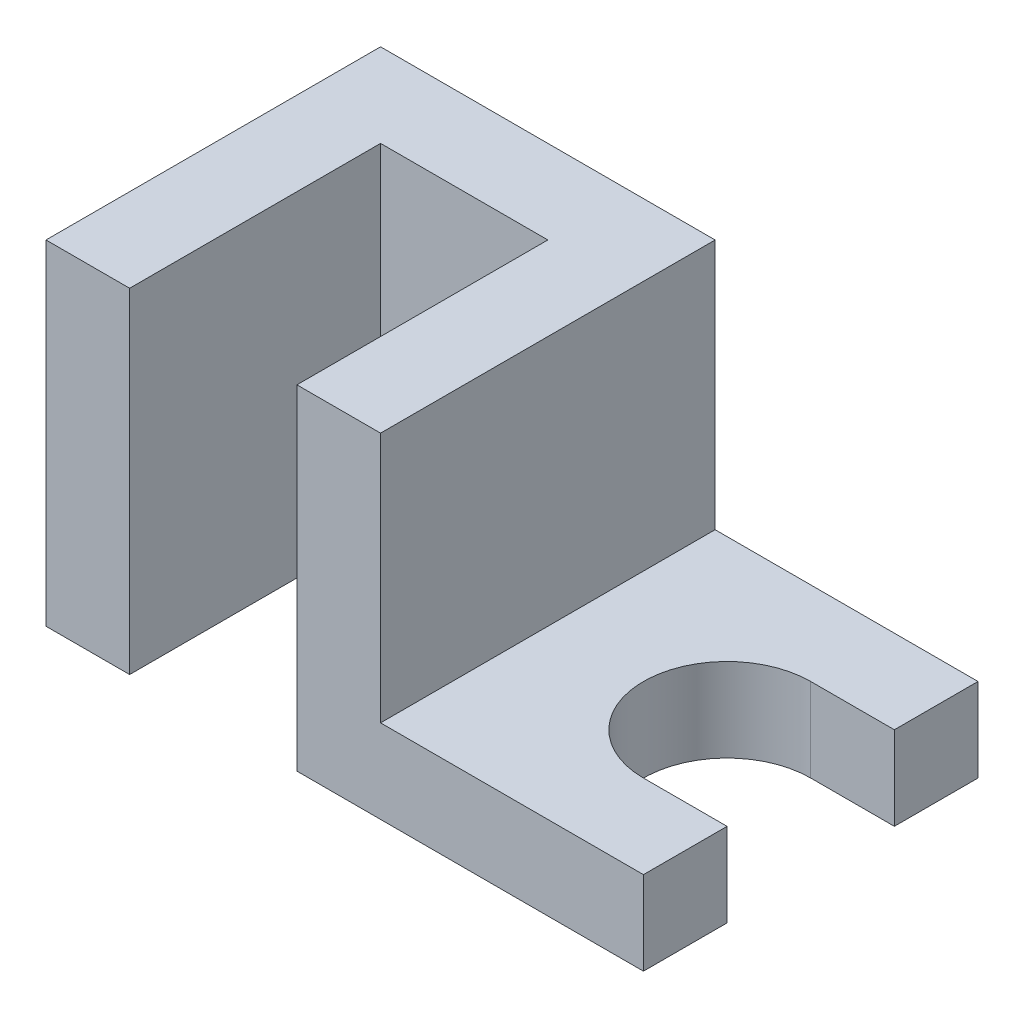
ISO-10303-21;
HEADER;
FILE_DESCRIPTION(('STEP AP214'),'2;1');
FILE_NAME('part.step','',(''),(''),'','','');
FILE_SCHEMA(('AUTOMOTIVE_DESIGN { 1 0 10303 214 1 1 1 1 }'));
ENDSEC;
DATA;
#1=APPLICATION_CONTEXT('core data for automotive mechanical design processes');
#2=APPLICATION_PROTOCOL_DEFINITION('international standard','automotive_design',2000,#1);
#3=PRODUCT_CONTEXT('',#1,'mechanical');
#4=PRODUCT('Part','Part','',(#3));
#5=PRODUCT_RELATED_PRODUCT_CATEGORY('part','',(#4));
#6=PRODUCT_DEFINITION_FORMATION('','',#4);
#7=PRODUCT_DEFINITION_CONTEXT('part definition',#1,'design');
#8=PRODUCT_DEFINITION('design','',#6,#7);
#9=PRODUCT_DEFINITION_SHAPE('','',#8);
#10=(LENGTH_UNIT() NAMED_UNIT(*) SI_UNIT(.MILLI.,.METRE.));
#11=(NAMED_UNIT(*) PLANE_ANGLE_UNIT() SI_UNIT($,.RADIAN.));
#12=(NAMED_UNIT(*) SI_UNIT($,.STERADIAN.) SOLID_ANGLE_UNIT());
#13=UNCERTAINTY_MEASURE_WITH_UNIT(LENGTH_MEASURE(1.E-05),#10,'distance_accuracy_value','');
#14=(GEOMETRIC_REPRESENTATION_CONTEXT(3) GLOBAL_UNCERTAINTY_ASSIGNED_CONTEXT((#13)) GLOBAL_UNIT_ASSIGNED_CONTEXT((#10,
#11,#12)) REPRESENTATION_CONTEXT('',''));
#15=CARTESIAN_POINT('',(0.,0.,0.));
#16=DIRECTION('',(0.,0.,1.));
#17=DIRECTION('',(1.,0.,0.));
#18=AXIS2_PLACEMENT_3D('',#15,#16,#17);
#19=CARTESIAN_POINT('',(0.,28.,0.));
#20=DIRECTION('',(1.,0.,0.));
#21=DIRECTION('',(0.,0.,-1.));
#22=AXIS2_PLACEMENT_3D('',#19,#20,#21);
#23=PLANE('',#22);
#24=DIRECTION('',(0.,0.,1.));
#25=VECTOR('',#24,1.);
#26=CARTESIAN_POINT('',(0.,0.,0.));
#27=LINE('',#26,#25);
#28=CARTESIAN_POINT('',(0.,0.,-28.));
#29=VERTEX_POINT('',#28);
#30=CARTESIAN_POINT('',(0.,0.,0.));
#31=VERTEX_POINT('',#30);
#32=EDGE_CURVE('E150',#29,#31,#27,.T.);
#33=ORIENTED_EDGE('',*,*,#32,.T.);
#34=DIRECTION('',(0.,-1.,0.));
#35=VECTOR('',#34,1.);
#36=CARTESIAN_POINT('',(0.,28.,0.));
#37=LINE('',#36,#35);
#38=CARTESIAN_POINT('',(0.,28.,0.));
#39=VERTEX_POINT('',#38);
#40=EDGE_CURVE('E11',#39,#31,#37,.T.);
#41=ORIENTED_EDGE('',*,*,#40,.F.);
#42=DIRECTION('',(0.,0.,1.));
#43=VECTOR('',#42,1.);
#44=CARTESIAN_POINT('',(0.,28.,0.));
#45=LINE('',#44,#43);
#46=CARTESIAN_POINT('',(0.,28.,-28.));
#47=VERTEX_POINT('',#46);
#48=EDGE_CURVE('E180',#47,#39,#45,.T.);
#49=ORIENTED_EDGE('',*,*,#48,.F.);
#50=DIRECTION('',(0.,-1.,0.));
#51=VECTOR('',#50,1.);
#52=CARTESIAN_POINT('',(0.,28.,-28.));
#53=LINE('',#52,#51);
#54=EDGE_CURVE('E149',#47,#29,#53,.T.);
#55=ORIENTED_EDGE('',*,*,#54,.T.);
#56=EDGE_LOOP('',(#33,#41,#49,#55));
#57=FACE_BOUND('',#56,.T.);
#58=ADVANCED_FACE('F33',(#57),#23,.F.);
#59=CARTESIAN_POINT('',(0.,28.,0.));
#60=DIRECTION('',(0.,0.,-1.));
#61=DIRECTION('',(-1.,0.,0.));
#62=AXIS2_PLACEMENT_3D('',#59,#60,#61);
#63=PLANE('',#62);
#64=DIRECTION('',(1.,0.,0.));
#65=VECTOR('',#64,1.);
#66=CARTESIAN_POINT('',(0.,0.,0.));
#67=LINE('',#66,#65);
#68=CARTESIAN_POINT('',(7.,0.,0.));
#69=VERTEX_POINT('',#68);
#70=EDGE_CURVE('E153',#31,#69,#67,.T.);
#71=ORIENTED_EDGE('',*,*,#70,.T.);
#72=DIRECTION('',(0.,-1.,0.));
#73=VECTOR('',#72,1.);
#74=CARTESIAN_POINT('',(7.,28.,0.));
#75=LINE('',#74,#73);
#76=CARTESIAN_POINT('',(7.,28.,0.));
#77=VERTEX_POINT('',#76);
#78=EDGE_CURVE('E40',#77,#69,#75,.T.);
#79=ORIENTED_EDGE('',*,*,#78,.F.);
#80=DIRECTION('',(1.,0.,0.));
#81=VECTOR('',#80,1.);
#82=CARTESIAN_POINT('',(0.,28.,0.));
#83=LINE('',#82,#81);
#84=EDGE_CURVE('E108',#39,#77,#83,.T.);
#85=ORIENTED_EDGE('',*,*,#84,.F.);
#86=ORIENTED_EDGE('',*,*,#40,.T.);
#87=EDGE_LOOP('',(#71,#79,#85,#86));
#88=FACE_BOUND('',#87,.T.);
#89=ADVANCED_FACE('F269',(#88),#63,.F.);
#90=CARTESIAN_POINT('',(7.,28.,0.));
#91=DIRECTION('',(-1.,0.,0.));
#92=DIRECTION('',(0.,0.,1.));
#93=AXIS2_PLACEMENT_3D('',#90,#91,#92);
#94=PLANE('',#93);
#95=DIRECTION('',(0.,0.,-1.));
#96=VECTOR('',#95,1.);
#97=CARTESIAN_POINT('',(7.,0.,0.));
#98=LINE('',#97,#96);
#99=CARTESIAN_POINT('',(7.,0.,-21.));
#100=VERTEX_POINT('',#99);
#101=EDGE_CURVE('E156',#69,#100,#98,.T.);
#102=ORIENTED_EDGE('',*,*,#101,.T.);
#103=DIRECTION('',(0.,-1.,0.));
#104=VECTOR('',#103,1.);
#105=CARTESIAN_POINT('',(7.,28.,-21.));
#106=LINE('',#105,#104);
#107=CARTESIAN_POINT('',(7.,28.,-21.));
#108=VERTEX_POINT('',#107);
#109=EDGE_CURVE('E137',#108,#100,#106,.T.);
#110=ORIENTED_EDGE('',*,*,#109,.F.);
#111=DIRECTION('',(0.,0.,-1.));
#112=VECTOR('',#111,1.);
#113=CARTESIAN_POINT('',(7.,28.,0.));
#114=LINE('',#113,#112);
#115=EDGE_CURVE('E125',#77,#108,#114,.T.);
#116=ORIENTED_EDGE('',*,*,#115,.F.);
#117=ORIENTED_EDGE('',*,*,#78,.T.);
#118=EDGE_LOOP('',(#102,#110,#116,#117));
#119=FACE_BOUND('',#118,.T.);
#120=ADVANCED_FACE('F198',(#119),#94,.F.);
#121=CARTESIAN_POINT('',(7.,28.,-21.));
#122=DIRECTION('',(0.,0.,-1.));
#123=DIRECTION('',(-1.,0.,0.));
#124=AXIS2_PLACEMENT_3D('',#121,#122,#123);
#125=PLANE('',#124);
#126=DIRECTION('',(1.,0.,0.));
#127=VECTOR('',#126,1.);
#128=CARTESIAN_POINT('',(7.,0.,-21.));
#129=LINE('',#128,#127);
#130=CARTESIAN_POINT('',(21.,0.,-21.));
#131=VERTEX_POINT('',#130);
#132=EDGE_CURVE('E134',#100,#131,#129,.T.);
#133=ORIENTED_EDGE('',*,*,#132,.T.);
#134=DIRECTION('',(0.,-1.,0.));
#135=VECTOR('',#134,1.);
#136=CARTESIAN_POINT('',(21.,28.,-21.));
#137=LINE('',#136,#135);
#138=CARTESIAN_POINT('',(21.,28.,-21.));
#139=VERTEX_POINT('',#138);
#140=EDGE_CURVE('E131',#139,#131,#137,.T.);
#141=ORIENTED_EDGE('',*,*,#140,.F.);
#142=DIRECTION('',(1.,0.,0.));
#143=VECTOR('',#142,1.);
#144=CARTESIAN_POINT('',(7.,28.,-21.));
#145=LINE('',#144,#143);
#146=EDGE_CURVE('E117',#108,#139,#145,.T.);
#147=ORIENTED_EDGE('',*,*,#146,.F.);
#148=ORIENTED_EDGE('',*,*,#109,.T.);
#149=EDGE_LOOP('',(#133,#141,#147,#148));
#150=FACE_BOUND('',#149,.T.);
#151=ADVANCED_FACE('F132',(#150),#125,.F.);
#152=CARTESIAN_POINT('',(21.,28.,0.));
#153=DIRECTION('',(1.,0.,0.));
#154=DIRECTION('',(0.,0.,-1.));
#155=AXIS2_PLACEMENT_3D('',#152,#153,#154);
#156=PLANE('',#155);
#157=DIRECTION('',(0.,0.,1.));
#158=VECTOR('',#157,1.);
#159=CARTESIAN_POINT('',(21.,0.,0.));
#160=LINE('',#159,#158);
#161=CARTESIAN_POINT('',(21.,0.,0.));
#162=VERTEX_POINT('',#161);
#163=EDGE_CURVE('E159',#131,#162,#160,.T.);
#164=ORIENTED_EDGE('',*,*,#163,.T.);
#165=DIRECTION('',(0.,-1.,0.));
#166=VECTOR('',#165,1.);
#167=CARTESIAN_POINT('',(21.,28.,0.));
#168=LINE('',#167,#166);
#169=CARTESIAN_POINT('',(21.,28.,0.));
#170=VERTEX_POINT('',#169);
#171=EDGE_CURVE('E138',#170,#162,#168,.T.);
#172=ORIENTED_EDGE('',*,*,#171,.F.);
#173=DIRECTION('',(0.,0.,1.));
#174=VECTOR('',#173,1.);
#175=CARTESIAN_POINT('',(21.,28.,0.));
#176=LINE('',#175,#174);
#177=EDGE_CURVE('E122',#139,#170,#176,.T.);
#178=ORIENTED_EDGE('',*,*,#177,.F.);
#179=ORIENTED_EDGE('',*,*,#140,.T.);
#180=EDGE_LOOP('',(#164,#172,#178,#179));
#181=FACE_BOUND('',#180,.T.);
#182=ADVANCED_FACE('F140',(#181),#156,.F.);
#183=CARTESIAN_POINT('',(21.,28.,0.));
#184=DIRECTION('',(0.,0.,-1.));
#185=DIRECTION('',(-1.,0.,0.));
#186=AXIS2_PLACEMENT_3D('',#183,#184,#185);
#187=PLANE('',#186);
#188=DIRECTION('',(1.,0.,0.));
#189=VECTOR('',#188,1.);
#190=CARTESIAN_POINT('',(28.,7.,0.));
#191=LINE('',#190,#189);
#192=CARTESIAN_POINT('',(28.,7.,0.));
#193=VERTEX_POINT('',#192);
#194=CARTESIAN_POINT('',(50.,7.,0.));
#195=VERTEX_POINT('',#194);
#196=EDGE_CURVE('E404',#193,#195,#191,.T.);
#197=ORIENTED_EDGE('',*,*,#196,.F.);
#198=DIRECTION('',(0.,-1.,0.));
#199=VECTOR('',#198,1.);
#200=CARTESIAN_POINT('',(28.,28.,0.));
#201=LINE('',#200,#199);
#202=CARTESIAN_POINT('',(28.,28.,0.));
#203=VERTEX_POINT('',#202);
#204=EDGE_CURVE('E211',#203,#193,#201,.T.);
#205=ORIENTED_EDGE('',*,*,#204,.F.);
#206=DIRECTION('',(1.,0.,0.));
#207=VECTOR('',#206,1.);
#208=CARTESIAN_POINT('',(21.,28.,0.));
#209=LINE('',#208,#207);
#210=EDGE_CURVE('E143',#170,#203,#209,.T.);
#211=ORIENTED_EDGE('',*,*,#210,.F.);
#212=ORIENTED_EDGE('',*,*,#171,.T.);
#213=DIRECTION('',(1.,0.,0.));
#214=VECTOR('',#213,1.);
#215=CARTESIAN_POINT('',(21.,0.,0.));
#216=LINE('',#215,#214);
#217=CARTESIAN_POINT('',(50.,0.,0.));
#218=VERTEX_POINT('',#217);
#219=EDGE_CURVE('E161',#162,#218,#216,.T.);
#220=ORIENTED_EDGE('',*,*,#219,.T.);
#221=DIRECTION('',(0.,-1.,0.));
#222=VECTOR('',#221,1.);
#223=CARTESIAN_POINT('',(50.,28.,0.));
#224=LINE('',#223,#222);
#225=EDGE_CURVE('E192',#195,#218,#224,.T.);
#226=ORIENTED_EDGE('',*,*,#225,.F.);
#227=EDGE_LOOP('',(#197,#205,#211,#212,#220,#226));
#228=FACE_BOUND('',#227,.T.);
#229=ADVANCED_FACE('F206',(#228),#187,.F.);
#230=CARTESIAN_POINT('',(50.,28.,0.));
#231=DIRECTION('',(-1.,0.,0.));
#232=DIRECTION('',(0.,0.,1.));
#233=AXIS2_PLACEMENT_3D('',#230,#231,#232);
#234=PLANE('',#233);
#235=DIRECTION('',(0.,-1.,0.));
#236=VECTOR('',#235,1.);
#237=CARTESIAN_POINT('',(50.,28.,-7.));
#238=LINE('',#237,#236);
#239=CARTESIAN_POINT('',(50.,7.,-7.));
#240=VERTEX_POINT('',#239);
#241=CARTESIAN_POINT('',(50.,0.,-7.));
#242=VERTEX_POINT('',#241);
#243=EDGE_CURVE('E190',#240,#242,#238,.T.);
#244=ORIENTED_EDGE('',*,*,#243,.F.);
#245=DIRECTION('',(0.,0.,1.));
#246=VECTOR('',#245,1.);
#247=CARTESIAN_POINT('',(50.,7.,-28.));
#248=LINE('',#247,#246);
#249=EDGE_CURVE('E238',#240,#195,#248,.T.);
#250=ORIENTED_EDGE('',*,*,#249,.T.);
#251=ORIENTED_EDGE('',*,*,#225,.T.);
#252=DIRECTION('',(0.,0.,-1.));
#253=VECTOR('',#252,1.);
#254=CARTESIAN_POINT('',(50.,0.,0.));
#255=LINE('',#254,#253);
#256=EDGE_CURVE('E164',#218,#242,#255,.T.);
#257=ORIENTED_EDGE('',*,*,#256,.T.);
#258=EDGE_LOOP('',(#244,#250,#251,#257));
#259=FACE_BOUND('',#258,.T.);
#260=ADVANCED_FACE('F283',(#259),#234,.F.);
#261=CARTESIAN_POINT('',(43.,28.,-7.));
#262=DIRECTION('',(0.,0.,1.));
#263=DIRECTION('',(1.,0.,0.));
#264=AXIS2_PLACEMENT_3D('',#261,#262,#263);
#265=PLANE('',#264);
#266=DIRECTION('',(0.,-1.,0.));
#267=VECTOR('',#266,1.);
#268=CARTESIAN_POINT('',(43.,28.,-7.));
#269=LINE('',#268,#267);
#270=CARTESIAN_POINT('',(43.,7.,-7.));
#271=VERTEX_POINT('',#270);
#272=CARTESIAN_POINT('',(43.,0.,-7.));
#273=VERTEX_POINT('',#272);
#274=EDGE_CURVE('E188',#271,#273,#269,.T.);
#275=ORIENTED_EDGE('',*,*,#274,.F.);
#276=DIRECTION('',(1.,0.,0.));
#277=VECTOR('',#276,1.);
#278=CARTESIAN_POINT('',(43.,7.,-7.));
#279=LINE('',#278,#277);
#280=EDGE_CURVE('E154',#271,#240,#279,.T.);
#281=ORIENTED_EDGE('',*,*,#280,.T.);
#282=ORIENTED_EDGE('',*,*,#243,.T.);
#283=DIRECTION('',(-1.,0.,0.));
#284=VECTOR('',#283,1.);
#285=CARTESIAN_POINT('',(43.,0.,-7.));
#286=LINE('',#285,#284);
#287=EDGE_CURVE('E167',#242,#273,#286,.T.);
#288=ORIENTED_EDGE('',*,*,#287,.T.);
#289=EDGE_LOOP('',(#275,#281,#282,#288));
#290=FACE_BOUND('',#289,.T.);
#291=ADVANCED_FACE('F248',(#290),#265,.F.);
#292=CARTESIAN_POINT('',(43.,28.,-14.));
#293=DIRECTION('',(0.,-1.,0.));
#294=DIRECTION('',(0.,0.,-1.));
#295=AXIS2_PLACEMENT_3D('',#292,#293,#294);
#296=CYLINDRICAL_SURFACE('',#295,7.);
#297=DIRECTION('',(0.,-1.,0.));
#298=VECTOR('',#297,1.);
#299=CARTESIAN_POINT('',(43.,28.,-21.));
#300=LINE('',#299,#298);
#301=CARTESIAN_POINT('',(43.,7.,-21.));
#302=VERTEX_POINT('',#301);
#303=CARTESIAN_POINT('',(43.,0.,-21.));
#304=VERTEX_POINT('',#303);
#305=EDGE_CURVE('E186',#302,#304,#300,.T.);
#306=ORIENTED_EDGE('',*,*,#305,.F.);
#307=CARTESIAN_POINT('',(43.,7.,-14.));
#308=DIRECTION('',(0.,-1.,0.));
#309=DIRECTION('',(1.,0.,0.));
#310=AXIS2_PLACEMENT_3D('',#307,#308,#309);
#311=CIRCLE('',#310,7.);
#312=EDGE_CURVE('E233',#302,#271,#311,.F.);
#313=ORIENTED_EDGE('',*,*,#312,.T.);
#314=ORIENTED_EDGE('',*,*,#274,.T.);
#315=CARTESIAN_POINT('',(43.,0.,-14.));
#316=DIRECTION('',(0.,-1.,0.));
#317=DIRECTION('',(0.,0.,1.));
#318=AXIS2_PLACEMENT_3D('',#315,#316,#317);
#319=CIRCLE('',#318,7.);
#320=EDGE_CURVE('E170',#273,#304,#319,.T.);
#321=ORIENTED_EDGE('',*,*,#320,.T.);
#322=EDGE_LOOP('',(#306,#313,#314,#321));
#323=FACE_BOUND('',#322,.T.);
#324=ADVANCED_FACE('F245',(#323),#296,.F.);
#325=CARTESIAN_POINT('',(43.,28.,-21.));
#326=DIRECTION('',(0.,0.,-1.));
#327=DIRECTION('',(-1.,0.,0.));
#328=AXIS2_PLACEMENT_3D('',#325,#326,#327);
#329=PLANE('',#328);
#330=DIRECTION('',(0.,-1.,0.));
#331=VECTOR('',#330,1.);
#332=CARTESIAN_POINT('',(50.,28.,-21.));
#333=LINE('',#332,#331);
#334=CARTESIAN_POINT('',(50.,7.,-21.));
#335=VERTEX_POINT('',#334);
#336=CARTESIAN_POINT('',(50.,0.,-21.));
#337=VERTEX_POINT('',#336);
#338=EDGE_CURVE('E184',#335,#337,#333,.T.);
#339=ORIENTED_EDGE('',*,*,#338,.F.);
#340=DIRECTION('',(-1.,0.,0.));
#341=VECTOR('',#340,1.);
#342=CARTESIAN_POINT('',(43.,7.,-21.));
#343=LINE('',#342,#341);
#344=EDGE_CURVE('E246',#335,#302,#343,.T.);
#345=ORIENTED_EDGE('',*,*,#344,.T.);
#346=ORIENTED_EDGE('',*,*,#305,.T.);
#347=DIRECTION('',(1.,0.,0.));
#348=VECTOR('',#347,1.);
#349=CARTESIAN_POINT('',(43.,0.,-21.));
#350=LINE('',#349,#348);
#351=EDGE_CURVE('E173',#304,#337,#350,.T.);
#352=ORIENTED_EDGE('',*,*,#351,.T.);
#353=EDGE_LOOP('',(#339,#345,#346,#352));
#354=FACE_BOUND('',#353,.T.);
#355=ADVANCED_FACE('F255',(#354),#329,.F.);
#356=CARTESIAN_POINT('',(50.,28.,-21.));
#357=DIRECTION('',(-1.,0.,0.));
#358=DIRECTION('',(0.,0.,1.));
#359=AXIS2_PLACEMENT_3D('',#356,#357,#358);
#360=PLANE('',#359);
#361=DIRECTION('',(0.,-1.,0.));
#362=VECTOR('',#361,1.);
#363=CARTESIAN_POINT('',(50.,28.,-28.));
#364=LINE('',#363,#362);
#365=CARTESIAN_POINT('',(50.,7.,-28.));
#366=VERTEX_POINT('',#365);
#367=CARTESIAN_POINT('',(50.,0.,-28.));
#368=VERTEX_POINT('',#367);
#369=EDGE_CURVE('E182',#366,#368,#364,.T.);
#370=ORIENTED_EDGE('',*,*,#369,.F.);
#371=EDGE_CURVE('E259',#366,#335,#248,.T.);
#372=ORIENTED_EDGE('',*,*,#371,.T.);
#373=ORIENTED_EDGE('',*,*,#338,.T.);
#374=DIRECTION('',(0.,0.,-1.));
#375=VECTOR('',#374,1.);
#376=CARTESIAN_POINT('',(50.,0.,-21.));
#377=LINE('',#376,#375);
#378=EDGE_CURVE('E176',#337,#368,#377,.T.);
#379=ORIENTED_EDGE('',*,*,#378,.T.);
#380=EDGE_LOOP('',(#370,#372,#373,#379));
#381=FACE_BOUND('',#380,.T.);
#382=ADVANCED_FACE('F293',(#381),#360,.F.);
#383=CARTESIAN_POINT('',(0.,28.,-28.));
#384=DIRECTION('',(0.,0.,1.));
#385=DIRECTION('',(1.,0.,0.));
#386=AXIS2_PLACEMENT_3D('',#383,#384,#385);
#387=PLANE('',#386);
#388=DIRECTION('',(-1.,0.,0.));
#389=VECTOR('',#388,1.);
#390=CARTESIAN_POINT('',(0.,28.,-28.));
#391=LINE('',#390,#389);
#392=CARTESIAN_POINT('',(28.,28.,-28.));
#393=VERTEX_POINT('',#392);
#394=EDGE_CURVE('E55',#393,#47,#391,.T.);
#395=ORIENTED_EDGE('',*,*,#394,.F.);
#396=DIRECTION('',(0.,-1.,0.));
#397=VECTOR('',#396,1.);
#398=CARTESIAN_POINT('',(28.,28.,-28.));
#399=LINE('',#398,#397);
#400=CARTESIAN_POINT('',(28.,7.,-28.));
#401=VERTEX_POINT('',#400);
#402=EDGE_CURVE('E47',#393,#401,#399,.T.);
#403=ORIENTED_EDGE('',*,*,#402,.T.);
#404=DIRECTION('',(1.,0.,0.));
#405=VECTOR('',#404,1.);
#406=CARTESIAN_POINT('',(28.,7.,-28.));
#407=LINE('',#406,#405);
#408=EDGE_CURVE('E407',#401,#366,#407,.T.);
#409=ORIENTED_EDGE('',*,*,#408,.T.);
#410=ORIENTED_EDGE('',*,*,#369,.T.);
#411=DIRECTION('',(-1.,0.,0.));
#412=VECTOR('',#411,1.);
#413=CARTESIAN_POINT('',(0.,0.,-28.));
#414=LINE('',#413,#412);
#415=EDGE_CURVE('E100',#368,#29,#414,.T.);
#416=ORIENTED_EDGE('',*,*,#415,.T.);
#417=ORIENTED_EDGE('',*,*,#54,.F.);
#418=EDGE_LOOP('',(#395,#403,#409,#410,#416,#417));
#419=FACE_BOUND('',#418,.T.);
#420=ADVANCED_FACE('F296',(#419),#387,.F.);
#421=CARTESIAN_POINT('',(43.,28.,-14.));
#422=DIRECTION('',(0.,1.,0.));
#423=DIRECTION('',(0.,0.,1.));
#424=AXIS2_PLACEMENT_3D('',#421,#422,#423);
#425=PLANE('',#424);
#426=DIRECTION('',(0.,0.,1.));
#427=VECTOR('',#426,1.);
#428=CARTESIAN_POINT('',(28.,28.,-28.));
#429=LINE('',#428,#427);
#430=EDGE_CURVE('E212',#393,#203,#429,.T.);
#431=ORIENTED_EDGE('',*,*,#430,.F.);
#432=ORIENTED_EDGE('',*,*,#394,.T.);
#433=ORIENTED_EDGE('',*,*,#48,.T.);
#434=ORIENTED_EDGE('',*,*,#84,.T.);
#435=ORIENTED_EDGE('',*,*,#115,.T.);
#436=ORIENTED_EDGE('',*,*,#146,.T.);
#437=ORIENTED_EDGE('',*,*,#177,.T.);
#438=ORIENTED_EDGE('',*,*,#210,.T.);
#439=EDGE_LOOP('',(#431,#432,#433,#434,#435,#436,#437,#438));
#440=FACE_BOUND('',#439,.T.);
#441=ADVANCED_FACE('F119',(#440),#425,.T.);
#442=CARTESIAN_POINT('',(43.,0.,-14.));
#443=DIRECTION('',(0.,1.,0.));
#444=DIRECTION('',(0.,0.,1.));
#445=AXIS2_PLACEMENT_3D('',#442,#443,#444);
#446=PLANE('',#445);
#447=ORIENTED_EDGE('',*,*,#32,.F.);
#448=ORIENTED_EDGE('',*,*,#415,.F.);
#449=ORIENTED_EDGE('',*,*,#378,.F.);
#450=ORIENTED_EDGE('',*,*,#351,.F.);
#451=ORIENTED_EDGE('',*,*,#320,.F.);
#452=ORIENTED_EDGE('',*,*,#287,.F.);
#453=ORIENTED_EDGE('',*,*,#256,.F.);
#454=ORIENTED_EDGE('',*,*,#219,.F.);
#455=ORIENTED_EDGE('',*,*,#163,.F.);
#456=ORIENTED_EDGE('',*,*,#132,.F.);
#457=ORIENTED_EDGE('',*,*,#101,.F.);
#458=ORIENTED_EDGE('',*,*,#70,.F.);
#459=EDGE_LOOP('',(#447,#448,#449,#450,#451,#452,#453,#454,#455,#456,#457,#458));
#460=FACE_BOUND('',#459,.T.);
#461=ADVANCED_FACE('F201',(#460),#446,.F.);
#462=CARTESIAN_POINT('',(28.,7.,-28.));
#463=DIRECTION('',(0.,-1.,0.));
#464=DIRECTION('',(1.,0.,0.));
#465=AXIS2_PLACEMENT_3D('',#462,#463,#464);
#466=PLANE('',#465);
#467=ORIENTED_EDGE('',*,*,#312,.F.);
#468=ORIENTED_EDGE('',*,*,#344,.F.);
#469=ORIENTED_EDGE('',*,*,#371,.F.);
#470=ORIENTED_EDGE('',*,*,#408,.F.);
#471=DIRECTION('',(0.,0.,1.));
#472=VECTOR('',#471,1.);
#473=CARTESIAN_POINT('',(28.,7.,-28.));
#474=LINE('',#473,#472);
#475=EDGE_CURVE('E262',#401,#193,#474,.T.);
#476=ORIENTED_EDGE('',*,*,#475,.T.);
#477=ORIENTED_EDGE('',*,*,#196,.T.);
#478=ORIENTED_EDGE('',*,*,#249,.F.);
#479=ORIENTED_EDGE('',*,*,#280,.F.);
#480=EDGE_LOOP('',(#467,#468,#469,#470,#476,#477,#478,#479));
#481=FACE_BOUND('',#480,.T.);
#482=ADVANCED_FACE('F236',(#481),#466,.F.);
#483=CARTESIAN_POINT('',(28.,28.,-28.));
#484=DIRECTION('',(-1.,0.,0.));
#485=DIRECTION('',(0.,-1.,0.));
#486=AXIS2_PLACEMENT_3D('',#483,#484,#485);
#487=PLANE('',#486);
#488=ORIENTED_EDGE('',*,*,#204,.T.);
#489=ORIENTED_EDGE('',*,*,#475,.F.);
#490=ORIENTED_EDGE('',*,*,#402,.F.);
#491=ORIENTED_EDGE('',*,*,#430,.T.);
#492=EDGE_LOOP('',(#488,#489,#490,#491));
#493=FACE_BOUND('',#492,.T.);
#494=ADVANCED_FACE('F304',(#493),#487,.F.);
#495=CLOSED_SHELL('',(#58,#89,#120,#151,#182,#229,#260,#291,#324,#355,#382,#420,#441,#461,#482,#494));
#496=MANIFOLD_SOLID_BREP('B2',#495);
#497=ADVANCED_BREP_SHAPE_REPRESENTATION('',(#18,#496),#14);
#498=SHAPE_DEFINITION_REPRESENTATION(#9,#497);
ENDSEC;
END-ISO-10303-21;
